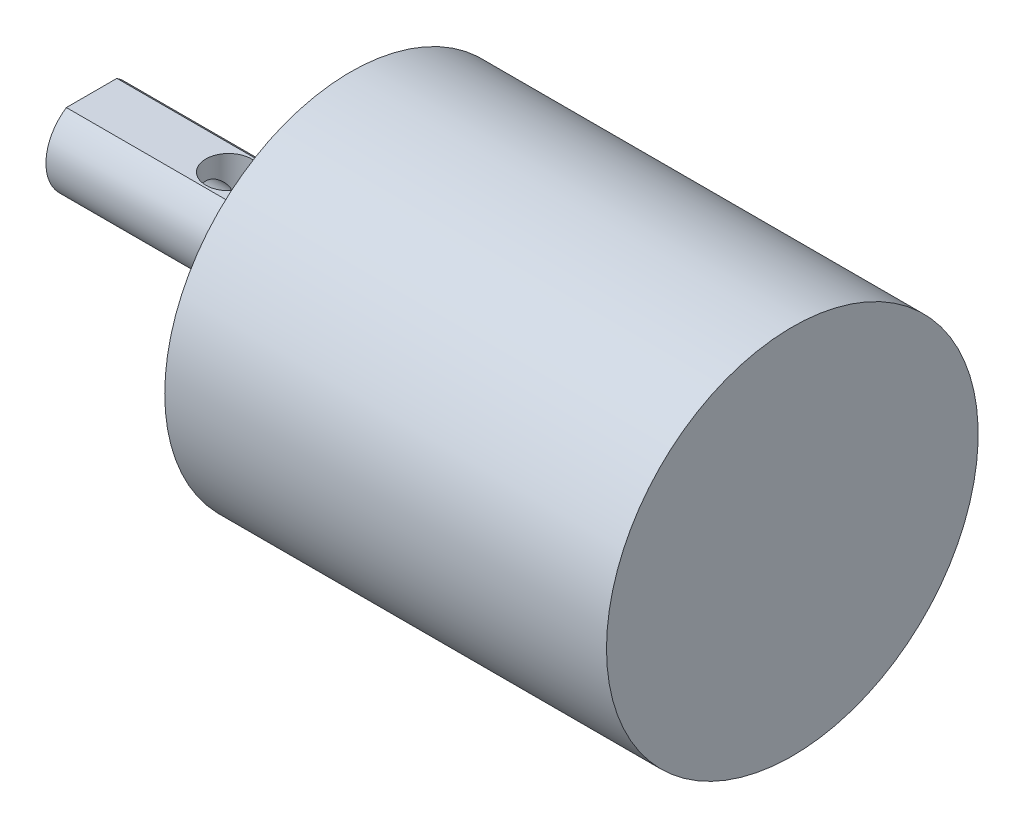
ISO-10303-21;
HEADER;
FILE_DESCRIPTION(('STEP AP214'),'2;1');
FILE_NAME('part.step','',(''),(''),'','','');
FILE_SCHEMA(('AUTOMOTIVE_DESIGN { 1 0 10303 214 1 1 1 1 }'));
ENDSEC;
DATA;
#1=APPLICATION_CONTEXT('core data for automotive mechanical design processes');
#2=APPLICATION_PROTOCOL_DEFINITION('international standard','automotive_design',2000,#1);
#3=PRODUCT_CONTEXT('',#1,'mechanical');
#4=PRODUCT('Part','Part','',(#3));
#5=PRODUCT_RELATED_PRODUCT_CATEGORY('part','',(#4));
#6=PRODUCT_DEFINITION_FORMATION('','',#4);
#7=PRODUCT_DEFINITION_CONTEXT('part definition',#1,'design');
#8=PRODUCT_DEFINITION('design','',#6,#7);
#9=PRODUCT_DEFINITION_SHAPE('','',#8);
#10=(LENGTH_UNIT() NAMED_UNIT(*) SI_UNIT(.MILLI.,.METRE.));
#11=(NAMED_UNIT(*) PLANE_ANGLE_UNIT() SI_UNIT($,.RADIAN.));
#12=(NAMED_UNIT(*) SI_UNIT($,.STERADIAN.) SOLID_ANGLE_UNIT());
#13=UNCERTAINTY_MEASURE_WITH_UNIT(LENGTH_MEASURE(1.E-05),#10,'distance_accuracy_value','');
#14=(GEOMETRIC_REPRESENTATION_CONTEXT(3) GLOBAL_UNCERTAINTY_ASSIGNED_CONTEXT((#13)) GLOBAL_UNIT_ASSIGNED_CONTEXT((#10,
#11,#12)) REPRESENTATION_CONTEXT('',''));
#15=CARTESIAN_POINT('',(0.,0.,0.));
#16=DIRECTION('',(0.,0.,1.));
#17=DIRECTION('',(1.,0.,0.));
#18=AXIS2_PLACEMENT_3D('',#15,#16,#17);
#19=CARTESIAN_POINT('',(-31.6,0.,-5.7));
#20=DIRECTION('',(-1.,0.,0.));
#21=DIRECTION('',(0.,0.,1.));
#22=AXIS2_PLACEMENT_3D('',#19,#20,#21);
#23=PLANE('',#22);
#24=CARTESIAN_POINT('',(-31.6,0.,-12.2));
#25=DIRECTION('',(-1.,0.,0.));
#26=DIRECTION('',(0.,0.,1.));
#27=AXIS2_PLACEMENT_3D('',#24,#25,#26);
#28=CIRCLE('',#27,6.5);
#29=CARTESIAN_POINT('',(-31.6,0.,-5.7));
#30=VERTEX_POINT('',#29);
#31=EDGE_CURVE('E246',#30,#30,#28,.T.);
#32=ORIENTED_EDGE('',*,*,#31,.T.);
#33=EDGE_LOOP('',(#32));
#34=FACE_BOUND('',#33,.T.);
#35=CARTESIAN_POINT('',(-31.6,0.,-12.2));
#36=DIRECTION('',(-1.,0.,0.));
#37=DIRECTION('',(0.,0.,1.));
#38=AXIS2_PLACEMENT_3D('',#35,#36,#37);
#39=CIRCLE('',#38,6.);
#40=CARTESIAN_POINT('',(-31.6,-6.,-12.2));
#41=VERTEX_POINT('',#40);
#42=CARTESIAN_POINT('',(-31.6,-1.5,-18.0094750193111));
#43=VERTEX_POINT('',#42);
#44=EDGE_CURVE('E436',#41,#43,#39,.T.);
#45=ORIENTED_EDGE('',*,*,#44,.F.);
#46=DIRECTION('',(0.,-0.866025403784439,-0.5));
#47=VECTOR('',#46,1.);
#48=CARTESIAN_POINT('',(-31.6,-1.5,-9.60192378864668));
#49=LINE('',#48,#47);
#50=CARTESIAN_POINT('',(-31.6,-1.5,-9.60192378864668));
#51=VERTEX_POINT('',#50);
#52=EDGE_CURVE('E137',#51,#41,#49,.T.);
#53=ORIENTED_EDGE('',*,*,#52,.F.);
#54=CARTESIAN_POINT('',(-31.6,0.,-12.2));
#55=DIRECTION('',(-1.,0.,0.));
#56=DIRECTION('',(0.,0.,1.));
#57=AXIS2_PLACEMENT_3D('',#54,#55,#56);
#58=CIRCLE('',#57,3.);
#59=CARTESIAN_POINT('',(-31.6,1.67021358881229,-14.692064719815));
#60=VERTEX_POINT('',#59);
#61=EDGE_CURVE('E251',#60,#51,#58,.T.);
#62=ORIENTED_EDGE('',*,*,#61,.F.);
#63=DIRECTION('',(0.,0.690885537617151,0.722964158109834));
#64=VECTOR('',#63,1.);
#65=CARTESIAN_POINT('',(-31.6,-1.5,-18.0094750193111));
#66=LINE('',#65,#64);
#67=EDGE_CURVE('E133',#43,#60,#66,.T.);
#68=ORIENTED_EDGE('',*,*,#67,.F.);
#69=EDGE_LOOP('',(#45,#53,#62,#68));
#70=FACE_BOUND('',#69,.T.);
#71=ADVANCED_FACE('F38',(#34,#70),#23,.T.);
#72=CARTESIAN_POINT('',(-38.,0.,-12.2));
#73=DIRECTION('',(-1.,0.,0.));
#74=DIRECTION('',(0.,0.,1.));
#75=AXIS2_PLACEMENT_3D('',#72,#73,#74);
#76=CONICAL_SURFACE('',#75,1.25,1.02974425867665);
#77=CARTESIAN_POINT('',(-38.,0.,-12.2));
#78=DIRECTION('',(-1.,0.,0.));
#79=DIRECTION('',(0.,0.,1.));
#80=AXIS2_PLACEMENT_3D('',#77,#78,#79);
#81=CIRCLE('',#80,1.25);
#82=CARTESIAN_POINT('',(-38.0000000000002,-0.559016994375681,-11.0819660112501));
#83=VERTEX_POINT('',#82);
#84=CARTESIAN_POINT('',(-38.,0.559016994374936,-11.0819660112501));
#85=VERTEX_POINT('',#84);
#86=EDGE_CURVE('E271',#83,#85,#81,.T.);
#87=ORIENTED_EDGE('',*,*,#86,.T.);
#88=CARTESIAN_POINT('',(-38.3344942997963,1.67182864536561,-11.5150730230041));
#89=CARTESIAN_POINT('',(-38.3163163138104,1.62461337100579,-11.4797356637797));
#90=CARTESIAN_POINT('',(-38.2978025805194,1.57566748458989,-11.4470411675325));
#91=CARTESIAN_POINT('',(-38.2606698289528,1.47505980079488,-11.3863641640652));
#92=CARTESIAN_POINT('',(-38.2420509887325,1.42340179901578,-11.3583752904652));
#93=CARTESIAN_POINT('',(-38.2053815652402,1.31844030869776,-11.3066681871802));
#94=CARTESIAN_POINT('',(-38.1873274518685,1.26515499935318,-11.2829149906069));
#95=CARTESIAN_POINT('',(-38.1520698863836,1.15684785990351,-11.2389955295993));
#96=CARTESIAN_POINT('',(-38.1348665247677,1.10182584607487,-11.2188296461695));
#97=CARTESIAN_POINT('',(-38.1033852794018,0.995697674053194,-11.1836131249123));
#98=CARTESIAN_POINT('',(-38.0889854408683,0.944728558681499,-11.1682561957033));
#99=CARTESIAN_POINT('',(-38.0597967193166,0.834790629296757,-11.1382438108772));
#100=CARTESIAN_POINT('',(-38.0452143086519,0.775665123675573,-11.1239581583983));
#101=CARTESIAN_POINT('',(-38.0184820113222,0.656159826572658,-11.0986219232742));
#102=CARTESIAN_POINT('',(-38.0063328702622,0.595779656871998,-11.087572331748));
#103=CARTESIAN_POINT('',(-37.985068558722,0.473955034575553,-11.0686985515051));
#104=CARTESIAN_POINT('',(-37.9759545724139,0.4125101764022,-11.0608756213938));
#105=CARTESIAN_POINT('',(-37.9613193541442,0.288888231348505,-11.0484978839004));
#106=CARTESIAN_POINT('',(-37.9557966272631,0.226711460126279,-11.0439417165944));
#107=CARTESIAN_POINT('',(-37.9481562249803,0.091785197213377,-11.037661195289));
#108=CARTESIAN_POINT('',(-37.9467411664683,0.0189659304869583,-11.0365201930432));
#109=CARTESIAN_POINT('',(-37.9494510655884,-0.126516316671805,-11.0387314295013));
#110=CARTESIAN_POINT('',(-37.9535776368067,-0.199179245411043,-11.0420849769067));
#111=CARTESIAN_POINT('',(-37.9669516642124,-0.343608566475454,-11.0532312688894));
#112=CARTESIAN_POINT('',(-37.9761946558375,-0.415375684730054,-11.0610201433929));
#113=CARTESIAN_POINT('',(-37.9989997200573,-0.557598976481524,-11.0809702950655));
#114=CARTESIAN_POINT('',(-38.0125620504795,-0.628055071455721,-11.0931318332509));
#115=CARTESIAN_POINT('',(-38.0350335922642,-0.730650743837737,-11.1142728399031));
#116=CARTESIAN_POINT('',(-38.0426353188876,-0.763441414072057,-11.1215586180901));
#117=CARTESIAN_POINT('',(-38.0584991446648,-0.828625285516783,-11.1371254386979));
#118=CARTESIAN_POINT('',(-38.0667613479999,-0.861018423088503,-11.1454066382372));
#119=CARTESIAN_POINT('',(-38.1063239543244,-1.01004829929829,-11.1860779268992));
#120=CARTESIAN_POINT('',(-38.1410813614023,-1.12425046766659,-11.2246088087335));
#121=CARTESIAN_POINT('',(-38.1956152274618,-1.28982918043749,-11.2937109068293));
#122=CARTESIAN_POINT('',(-38.214186750954,-1.34405225523453,-11.3186198725106));
#123=CARTESIAN_POINT('',(-38.2516536768637,-1.45020701245779,-11.3726873564154));
#124=CARTESIAN_POINT('',(-38.2705487937918,-1.50214058342003,-11.4018422834869));
#125=CARTESIAN_POINT('',(-38.3008539365346,-1.5835547390461,-11.4528133549099));
#126=CARTESIAN_POINT('',(-38.312335790628,-1.61395901587832,-11.4731137747238));
#127=CARTESIAN_POINT('',(-38.3350582152167,-1.67341145439771,-11.5157501672098));
#128=CARTESIAN_POINT('',(-38.3462987070951,-1.70245917773979,-11.5380867910544));
#129=CARTESIAN_POINT('',(-38.357337512517,-1.73069876832922,-11.561537098091));
#130=B_SPLINE_CURVE_WITH_KNOTS('',3,(#88,#89,#90,#91,#92,#93,#94,#95,#96,#97,#98,#99,#100,#101,
#102,#103,#104,#105,#106,#107,#108,#109,#110,#111,#112,#113,#114,#115,#116,#117,#118,#119,#120,
#121,#122,#123,#124,#125,#126,#127,#128,#129),.UNSPECIFIED.,.F.,.F.,(4,2,2,2,2,2,2,2,2,2,2,2,2,
2,2,2,2,2,2,2,4),(0.,0.184926237952774,0.369600234320969,0.552670945769802,0.735761089354847,
0.901113760928823,1.08862563519459,1.27619487943242,1.46383721870861,1.65140139875104,
1.86956952844741,2.08780119710176,2.3058427374226,2.52389729539921,2.62719498618184,
2.73050900306382,3.10546108420719,3.29282233419519,3.48002602819094,3.59491325714074,
3.70983735647541),.UNSPECIFIED.);
#131=EDGE_CURVE('E67',#85,#83,#130,.T.);
#132=ORIENTED_EDGE('',*,*,#131,.T.);
#133=EDGE_LOOP('',(#87,#132));
#134=FACE_BOUND('',#133,.T.);
#135=ADVANCED_FACE('F214',(#134),#76,.F.);
#136=CARTESIAN_POINT('',(-46.,0.,-12.2));
#137=DIRECTION('',(-1.,0.,0.));
#138=DIRECTION('',(0.,0.,1.));
#139=AXIS2_PLACEMENT_3D('',#136,#137,#138);
#140=CYLINDRICAL_SURFACE('',#139,3.);
#141=DIRECTION('',(1.,0.,0.));
#142=VECTOR('',#141,1.);
#143=CARTESIAN_POINT('',(-32.1,-1.5,-9.60192378864668));
#144=LINE('',#143,#142);
#145=CARTESIAN_POINT('',(-32.1,-1.5,-9.60192378864668));
#146=VERTEX_POINT('',#145);
#147=EDGE_CURVE('E439',#146,#51,#144,.T.);
#148=ORIENTED_EDGE('',*,*,#147,.F.);
#149=CARTESIAN_POINT('',(-32.1,0.,-12.2));
#150=DIRECTION('',(1.,0.,0.));
#151=DIRECTION('',(0.,0.,-1.));
#152=AXIS2_PLACEMENT_3D('',#149,#150,#151);
#153=CIRCLE('',#152,3.);
#154=CARTESIAN_POINT('',(-32.1,1.67021358881229,-14.692064719815));
#155=VERTEX_POINT('',#154);
#156=EDGE_CURVE('E130',#155,#146,#153,.T.);
#157=ORIENTED_EDGE('',*,*,#156,.F.);
#158=DIRECTION('',(1.,0.,0.));
#159=VECTOR('',#158,1.);
#160=CARTESIAN_POINT('',(-32.1,1.67021358881229,-14.692064719815));
#161=LINE('',#160,#159);
#162=EDGE_CURVE('E144',#155,#60,#161,.T.);
#163=ORIENTED_EDGE('',*,*,#162,.T.);
#164=ORIENTED_EDGE('',*,*,#61,.T.);
#165=EDGE_LOOP('',(#148,#157,#163,#164));
#166=FACE_BOUND('',#165,.T.);
#167=CARTESIAN_POINT('',(-37.,-2.59807621135331,-10.7));
#168=CARTESIAN_POINT('',(-37.0781617122929,-2.59808302092688,-10.7000054553882));
#169=CARTESIAN_POINT('',(-37.1564221172876,-2.60165701781634,-10.7061500439002));
#170=CARTESIAN_POINT('',(-37.3105408970157,-2.61543549678078,-10.7304151851529));
#171=CARTESIAN_POINT('',(-37.3863938725651,-2.62565391083339,-10.7485609031687));
#172=CARTESIAN_POINT('',(-37.5331774965159,-2.65124019908097,-10.7958500769503));
#173=CARTESIAN_POINT('',(-37.6041319787104,-2.66658065209878,-10.8249350712594));
#174=CARTESIAN_POINT('',(-37.7401363029951,-2.70063997225286,-10.8930987119354));
#175=CARTESIAN_POINT('',(-37.8051858253937,-2.71935902214096,-10.9321778989463));
#176=CARTESIAN_POINT('',(-37.9334585928363,-2.75995303586162,-11.0230001892037));
#177=CARTESIAN_POINT('',(-37.9960887035103,-2.7819609545693,-11.0755219457843));
#178=CARTESIAN_POINT('',(-38.1121125826101,-2.82557974178558,-11.1901192885783));
#179=CARTESIAN_POINT('',(-38.1655017438753,-2.84719040746875,-11.2521996113266));
#180=CARTESIAN_POINT('',(-38.2650507267215,-2.88932215429424,-11.3892656548782));
#181=CARTESIAN_POINT('',(-38.3104806517893,-2.90967159627259,-11.4648392164811));
#182=CARTESIAN_POINT('',(-38.3877112798686,-2.94526134149294,-11.6237644601007));
#183=CARTESIAN_POINT('',(-38.4195205842058,-2.96050486775612,-11.7071111927928));
#184=CARTESIAN_POINT('',(-38.4662569919517,-2.98320691866356,-11.872932584111));
#185=CARTESIAN_POINT('',(-38.4822242895333,-2.99114220331338,-11.9550473142668));
#186=CARTESIAN_POINT('',(-38.5002491780126,-3.000113757691,-12.1211440569532));
#187=CARTESIAN_POINT('',(-38.5023151851936,-3.00115420176885,-12.2051249087656));
#188=CARTESIAN_POINT('',(-38.4928799890445,-2.99644472874675,-12.3647487866356));
#189=CARTESIAN_POINT('',(-38.4825429767182,-2.99127743838241,-12.4404817987652));
#190=CARTESIAN_POINT('',(-38.450678734143,-2.97561367889621,-12.5889706578775));
#191=CARTESIAN_POINT('',(-38.4291506665357,-2.96511681099591,-12.6617262816409));
#192=CARTESIAN_POINT('',(-38.3753761508653,-2.93957374931481,-12.8034640873543));
#193=CARTESIAN_POINT('',(-38.3429855302419,-2.92446662293799,-12.8723801352728));
#194=CARTESIAN_POINT('',(-38.2686048756978,-2.89106468980031,-13.00396520227));
#195=CARTESIAN_POINT('',(-38.2266114050465,-2.87276874236226,-13.066631973258));
#196=CARTESIAN_POINT('',(-38.1296569727005,-2.83266591598844,-13.1902604913473));
#197=CARTESIAN_POINT('',(-38.073845457511,-2.81069063997262,-13.250501112544));
#198=CARTESIAN_POINT('',(-37.9531154126047,-2.76681510880217,-13.3611565554467));
#199=CARTESIAN_POINT('',(-37.8881899415889,-2.74491492398443,-13.4115638173613));
#200=CARTESIAN_POINT('',(-37.7460277113639,-2.70216234138727,-13.5042580019633));
#201=CARTESIAN_POINT('',(-37.6682709654187,-2.68146479986061,-13.5458259724671));
#202=CARTESIAN_POINT('',(-37.5055934929615,-2.64563175417864,-13.6149786695018));
#203=CARTESIAN_POINT('',(-37.4206803504737,-2.63049045069101,-13.6425779873163));
#204=CARTESIAN_POINT('',(-37.2531782330758,-2.60916953725551,-13.6807703165376));
#205=CARTESIAN_POINT('',(-37.1709383214347,-2.60237483772744,-13.69253768318));
#206=CARTESIAN_POINT('',(-37.0053979877252,-2.59676879042414,-13.7022754199171));
#207=CARTESIAN_POINT('',(-36.9220983563203,-2.59795180333967,-13.7002555359725));
#208=CARTESIAN_POINT('',(-36.7665191221319,-2.60751504810877,-13.6835540650159));
#209=CARTESIAN_POINT('',(-36.6940308233381,-2.61509381259981,-13.6702817250687));
#210=CARTESIAN_POINT('',(-36.5524483205936,-2.63541032327012,-13.6335444269487));
#211=CARTESIAN_POINT('',(-36.4833552238801,-2.64814974007551,-13.6100761679354));
#212=CARTESIAN_POINT('',(-36.3468830036459,-2.67804333119485,-13.5524713829073));
#213=CARTESIAN_POINT('',(-36.2797314747197,-2.69537464864595,-13.5178910955391));
#214=CARTESIAN_POINT('',(-36.1517960926915,-2.73234179245874,-13.4394305960237));
#215=CARTESIAN_POINT('',(-36.0910155347301,-2.75197880032721,-13.3955456064983));
#216=CARTESIAN_POINT('',(-35.9695318487147,-2.79431997684504,-13.2932557507983));
#217=CARTESIAN_POINT('',(-35.9098042739235,-2.81709874731434,-13.2337179084724));
#218=CARTESIAN_POINT('',(-35.8008816430096,-2.86101352466839,-13.1051067430974));
#219=CARTESIAN_POINT('',(-35.7516901446542,-2.88214897511564,-13.036030211983));
#220=CARTESIAN_POINT('',(-35.6641394110748,-2.92112042536435,-12.8878030438381));
#221=CARTESIAN_POINT('',(-35.6261003226836,-2.93885462508044,-12.8084346463612));
#222=CARTESIAN_POINT('',(-35.5642931442139,-2.96825032438951,-12.6432835469616));
#223=CARTESIAN_POINT('',(-35.5405125229505,-2.9799171551456,-12.5575065520883));
#224=CARTESIAN_POINT('',(-35.509947153738,-2.99501262272824,-12.3904695234956));
#225=CARTESIAN_POINT('',(-35.5018031861858,-2.99909891862287,-12.3095171657757));
#226=CARTESIAN_POINT('',(-35.4987351018184,-3.00063195562697,-12.1473110210732));
#227=CARTESIAN_POINT('',(-35.5038063572146,-2.99808102100335,-12.0660573495574));
#228=CARTESIAN_POINT('',(-35.5261246101934,-2.98700953256884,-11.9111930115243));
#229=CARTESIAN_POINT('',(-35.5425472738865,-2.97889342001985,-11.8374315232831));
#230=CARTESIAN_POINT('',(-35.5859904989545,-2.95788140495135,-11.6938310717246));
#231=CARTESIAN_POINT('',(-35.6130125801402,-2.94498481699193,-11.6239926725667));
#232=CARTESIAN_POINT('',(-35.6780905782489,-2.9148889612218,-11.4868648906327));
#233=CARTESIAN_POINT('',(-35.7165689848118,-2.89752925798198,-11.4198122859499));
#234=CARTESIAN_POINT('',(-35.8029368962886,-2.86032199712739,-11.292838037279));
#235=CARTESIAN_POINT('',(-35.8508307236735,-2.84047329837541,-11.2329196888776));
#236=CARTESIAN_POINT('',(-35.9601957085341,-2.79792915339941,-11.1156289937647));
#237=CARTESIAN_POINT('',(-36.0225437312158,-2.77514698517547,-11.0591034731911));
#238=CARTESIAN_POINT('',(-36.1561760816947,-2.73094614244278,-10.957005068908));
#239=CARTESIAN_POINT('',(-36.2274682313015,-2.70952868642798,-10.9114418749849));
#240=CARTESIAN_POINT('',(-36.3799549698714,-2.66999407957374,-10.8313533803215));
#241=CARTESIAN_POINT('',(-36.4613912966931,-2.65200261384405,-10.7972224010586));
#242=CARTESIAN_POINT('',(-36.6299986065097,-2.62299234492527,-10.7436819357404));
#243=CARTESIAN_POINT('',(-36.717149333369,-2.61195024221553,-10.724223213237));
#244=CARTESIAN_POINT('',(-36.837708033478,-2.60293908902686,-10.7084494882034));
#245=CARTESIAN_POINT('',(-36.8700518415968,-2.60112193507727,-10.7052858425542));
#246=CARTESIAN_POINT('',(-36.9349247210234,-2.59868903831625,-10.701059892365));
#247=CARTESIAN_POINT('',(-36.9674538045788,-2.59807337587664,-10.6999977284002));
#248=CARTESIAN_POINT('',(-37.,-2.59807621135331,-10.7));
#249=B_SPLINE_CURVE_WITH_KNOTS('',3,(#167,#168,#169,#170,#171,#172,#173,#174,#175,#176,#177,
#178,#179,#180,#181,#182,#183,#184,#185,#186,#187,#188,#189,#190,#191,#192,#193,#194,#195,#196,
#197,#198,#199,#200,#201,#202,#203,#204,#205,#206,#207,#208,#209,#210,#211,#212,#213,#214,#215,
#216,#217,#218,#219,#220,#221,#222,#223,#224,#225,#226,#227,#228,#229,#230,#231,#232,#233,#234,
#235,#236,#237,#238,#239,#240,#241,#242,#243,#244,#245,#246,#247,#248),.UNSPECIFIED.,.T.,.F.,(4,
2,2,2,2,2,2,2,2,2,2,2,2,2,2,2,2,2,2,2,2,2,2,2,2,2,2,2,2,2,2,2,2,2,2,2,2,2,2,2,4),(0.,
0.234348183892079,0.469189339237211,0.70279289387832,0.936409088167718,1.18929346874735,
1.44230356626557,1.71236838358146,1.98226240445838,2.23295227451904,2.48349035529061,
2.71224146226808,2.94100968776184,3.17294302096721,3.40495949025409,3.65890787185338,
3.91305072368879,4.18333262594173,4.45333161317559,4.70193436281319,4.95036139782561,
5.17161275136041,5.39293578654097,5.62450944609134,5.85620229330073,6.11710115370922,
6.37808797467306,6.64596272119451,6.9136016971316,7.15668405584232,7.3996813019096,
7.62666637307241,7.85368400268022,8.0904112607921,8.32724745151081,8.58765362775104,
8.84828914267734,9.11716123557911,9.38512699504143,9.48270202777967,9.58028358741813),.UNSPECIFIED.);
#250=CARTESIAN_POINT('',(-37.,-2.59807621135331,-10.7));
#251=VERTEX_POINT('',#250);
#252=EDGE_CURVE('E199',#251,#251,#249,.T.);
#253=ORIENTED_EDGE('',*,*,#252,.F.);
#254=EDGE_LOOP('',(#253));
#255=FACE_BOUND('',#254,.T.);
#256=CARTESIAN_POINT('',(-46.,0.,-12.2));
#257=DIRECTION('',(-1.,0.,0.));
#258=DIRECTION('',(0.,0.,1.));
#259=AXIS2_PLACEMENT_3D('',#256,#257,#258);
#260=CIRCLE('',#259,3.);
#261=CARTESIAN_POINT('',(-46.,2.5,-13.8583123951777));
#262=VERTEX_POINT('',#261);
#263=CARTESIAN_POINT('',(-46.,2.5,-10.5416876048223));
#264=VERTEX_POINT('',#263);
#265=EDGE_CURVE('E254',#262,#264,#260,.T.);
#266=ORIENTED_EDGE('',*,*,#265,.F.);
#267=DIRECTION('',(-1.,0.,0.));
#268=VECTOR('',#267,1.);
#269=CARTESIAN_POINT('',(-34.5,2.5,-13.8583123951777));
#270=LINE('',#269,#268);
#271=CARTESIAN_POINT('',(-34.5,2.5,-13.8583123951777));
#272=VERTEX_POINT('',#271);
#273=EDGE_CURVE('E257',#272,#262,#270,.T.);
#274=ORIENTED_EDGE('',*,*,#273,.F.);
#275=CARTESIAN_POINT('',(-34.5,0.,-12.2));
#276=DIRECTION('',(-1.,0.,0.));
#277=DIRECTION('',(0.,0.,1.));
#278=AXIS2_PLACEMENT_3D('',#275,#276,#277);
#279=CIRCLE('',#278,3.00000000000002);
#280=CARTESIAN_POINT('',(-34.5,2.5,-10.5416876048223));
#281=VERTEX_POINT('',#280);
#282=EDGE_CURVE('E261',#281,#272,#279,.T.);
#283=ORIENTED_EDGE('',*,*,#282,.F.);
#284=DIRECTION('',(-1.,0.,0.));
#285=VECTOR('',#284,1.);
#286=CARTESIAN_POINT('',(-34.5,2.5,-10.5416876048223));
#287=LINE('',#286,#285);
#288=EDGE_CURVE('E258',#281,#264,#287,.T.);
#289=ORIENTED_EDGE('',*,*,#288,.T.);
#290=EDGE_LOOP('',(#266,#274,#283,#289));
#291=FACE_BOUND('',#290,.T.);
#292=ADVANCED_FACE('F208',(#166,#255,#291),#140,.T.);
#293=CARTESIAN_POINT('',(-46.,0.,-9.19999999999999));
#294=DIRECTION('',(-1.,0.,0.));
#295=DIRECTION('',(0.,0.,1.));
#296=AXIS2_PLACEMENT_3D('',#293,#294,#295);
#297=PLANE('',#296);
#298=CARTESIAN_POINT('',(-46.,0.,-12.2));
#299=DIRECTION('',(-1.,0.,0.));
#300=DIRECTION('',(0.,0.,1.));
#301=AXIS2_PLACEMENT_3D('',#298,#299,#300);
#302=CIRCLE('',#301,1.25);
#303=CARTESIAN_POINT('',(-46.,0.,-10.95));
#304=VERTEX_POINT('',#303);
#305=EDGE_CURVE('E206',#304,#304,#302,.T.);
#306=ORIENTED_EDGE('',*,*,#305,.F.);
#307=EDGE_LOOP('',(#306));
#308=FACE_BOUND('',#307,.T.);
#309=ORIENTED_EDGE('',*,*,#265,.T.);
#310=DIRECTION('',(0.,0.,-1.));
#311=VECTOR('',#310,1.);
#312=CARTESIAN_POINT('',(-46.,2.5,-12.2));
#313=LINE('',#312,#311);
#314=EDGE_CURVE('E263',#264,#262,#313,.T.);
#315=ORIENTED_EDGE('',*,*,#314,.T.);
#316=EDGE_LOOP('',(#309,#315));
#317=FACE_BOUND('',#316,.T.);
#318=ADVANCED_FACE('F213',(#308,#317),#297,.T.);
#319=CARTESIAN_POINT('',(0.,0.,-12.2));
#320=DIRECTION('',(1.,0.,0.));
#321=DIRECTION('',(0.,0.,-1.));
#322=AXIS2_PLACEMENT_3D('',#319,#320,#321);
#323=PLANE('',#322);
#324=CARTESIAN_POINT('',(0.,0.,-12.2));
#325=DIRECTION('',(-1.,0.,0.));
#326=DIRECTION('',(0.,0.,1.));
#327=AXIS2_PLACEMENT_3D('',#324,#325,#326);
#328=CIRCLE('',#327,12.2);
#329=CARTESIAN_POINT('',(0.,0.,0.));
#330=VERTEX_POINT('',#329);
#331=EDGE_CURVE('E238',#330,#330,#328,.T.);
#332=ORIENTED_EDGE('',*,*,#331,.F.);
#333=EDGE_LOOP('',(#332));
#334=FACE_BOUND('',#333,.T.);
#335=ADVANCED_FACE('F40',(#334),#323,.T.);
#336=CARTESIAN_POINT('',(-46.,0.,-12.2));
#337=DIRECTION('',(-1.,0.,0.));
#338=DIRECTION('',(0.,0.,1.));
#339=AXIS2_PLACEMENT_3D('',#336,#337,#338);
#340=CYLINDRICAL_SURFACE('',#339,12.2);
#341=ORIENTED_EDGE('',*,*,#331,.T.);
#342=EDGE_LOOP('',(#341));
#343=FACE_BOUND('',#342,.T.);
#344=CARTESIAN_POINT('',(-29.,0.,-12.2));
#345=DIRECTION('',(-1.,0.,0.));
#346=DIRECTION('',(0.,0.,1.));
#347=AXIS2_PLACEMENT_3D('',#344,#345,#346);
#348=CIRCLE('',#347,12.2);
#349=CARTESIAN_POINT('',(-29.,0.,0.));
#350=VERTEX_POINT('',#349);
#351=EDGE_CURVE('E241',#350,#350,#348,.T.);
#352=ORIENTED_EDGE('',*,*,#351,.F.);
#353=EDGE_LOOP('',(#352));
#354=FACE_BOUND('',#353,.T.);
#355=ADVANCED_FACE('F227',(#343,#354),#340,.T.);
#356=CARTESIAN_POINT('',(-29.,0.,0.));
#357=DIRECTION('',(-1.,0.,0.));
#358=DIRECTION('',(0.,0.,1.));
#359=AXIS2_PLACEMENT_3D('',#356,#357,#358);
#360=PLANE('',#359);
#361=CARTESIAN_POINT('',(-29.,9.5,-12.2));
#362=DIRECTION('',(-1.,0.,0.));
#363=DIRECTION('',(0.,0.,1.));
#364=AXIS2_PLACEMENT_3D('',#361,#362,#363);
#365=CIRCLE('',#364,1.25);
#366=CARTESIAN_POINT('',(-29.,9.5,-10.95));
#367=VERTEX_POINT('',#366);
#368=EDGE_CURVE('E139',#367,#367,#365,.T.);
#369=ORIENTED_EDGE('',*,*,#368,.F.);
#370=EDGE_LOOP('',(#369));
#371=FACE_BOUND('',#370,.T.);
#372=CARTESIAN_POINT('',(-29.,-4.75000000000016,-20.4272413359518));
#373=DIRECTION('',(-1.,0.,0.));
#374=DIRECTION('',(0.,0.,1.));
#375=AXIS2_PLACEMENT_3D('',#372,#373,#374);
#376=CIRCLE('',#375,1.25);
#377=CARTESIAN_POINT('',(-29.,-4.75000000000016,-19.1772413359518));
#378=VERTEX_POINT('',#377);
#379=EDGE_CURVE('E150',#378,#378,#376,.T.);
#380=ORIENTED_EDGE('',*,*,#379,.F.);
#381=EDGE_LOOP('',(#380));
#382=FACE_BOUND('',#381,.T.);
#383=CARTESIAN_POINT('',(-29.,-4.74999999999981,-3.97275866404745));
#384=DIRECTION('',(-1.,0.,0.));
#385=DIRECTION('',(0.,0.,1.));
#386=AXIS2_PLACEMENT_3D('',#383,#384,#385);
#387=CIRCLE('',#386,1.25);
#388=CARTESIAN_POINT('',(-29.,-4.74999999999981,-2.72275866404745));
#389=VERTEX_POINT('',#388);
#390=EDGE_CURVE('E156',#389,#389,#387,.T.);
#391=ORIENTED_EDGE('',*,*,#390,.F.);
#392=EDGE_LOOP('',(#391));
#393=FACE_BOUND('',#392,.T.);
#394=ORIENTED_EDGE('',*,*,#351,.T.);
#395=EDGE_LOOP('',(#394));
#396=FACE_BOUND('',#395,.T.);
#397=CARTESIAN_POINT('',(-29.,0.,-12.2));
#398=DIRECTION('',(-1.,0.,0.));
#399=DIRECTION('',(0.,0.,1.));
#400=AXIS2_PLACEMENT_3D('',#397,#398,#399);
#401=CIRCLE('',#400,6.5);
#402=CARTESIAN_POINT('',(-29.,0.,-5.7));
#403=VERTEX_POINT('',#402);
#404=EDGE_CURVE('E243',#403,#403,#401,.T.);
#405=ORIENTED_EDGE('',*,*,#404,.F.);
#406=EDGE_LOOP('',(#405));
#407=FACE_BOUND('',#406,.T.);
#408=ADVANCED_FACE('F224',(#371,#382,#393,#396,#407),#360,.T.);
#409=CARTESIAN_POINT('',(-46.,0.,-12.2));
#410=DIRECTION('',(-1.,0.,0.));
#411=DIRECTION('',(0.,0.,1.));
#412=AXIS2_PLACEMENT_3D('',#409,#410,#411);
#413=CYLINDRICAL_SURFACE('',#412,6.5);
#414=ORIENTED_EDGE('',*,*,#404,.T.);
#415=EDGE_LOOP('',(#414));
#416=FACE_BOUND('',#415,.T.);
#417=ORIENTED_EDGE('',*,*,#31,.F.);
#418=EDGE_LOOP('',(#417));
#419=FACE_BOUND('',#418,.T.);
#420=ADVANCED_FACE('F220',(#416,#419),#413,.T.);
#421=CARTESIAN_POINT('',(-34.5,2.5,-12.2));
#422=DIRECTION('',(0.,1.,0.));
#423=DIRECTION('',(0.,0.,1.));
#424=AXIS2_PLACEMENT_3D('',#421,#422,#423);
#425=PLANE('',#424);
#426=CARTESIAN_POINT('',(-37.,2.5,-12.2));
#427=DIRECTION('',(0.,1.,0.));
#428=DIRECTION('',(0.,0.,1.));
#429=AXIS2_PLACEMENT_3D('',#426,#427,#428);
#430=CIRCLE('',#429,1.5);
#431=CARTESIAN_POINT('',(-37.,2.5,-10.7));
#432=VERTEX_POINT('',#431);
#433=EDGE_CURVE('E162',#432,#432,#430,.T.);
#434=ORIENTED_EDGE('',*,*,#433,.F.);
#435=EDGE_LOOP('',(#434));
#436=FACE_BOUND('',#435,.T.);
#437=ORIENTED_EDGE('',*,*,#314,.F.);
#438=ORIENTED_EDGE('',*,*,#288,.F.);
#439=DIRECTION('',(0.,0.,1.));
#440=VECTOR('',#439,1.);
#441=CARTESIAN_POINT('',(-34.5,2.5,-12.2));
#442=LINE('',#441,#440);
#443=EDGE_CURVE('E266',#272,#281,#442,.T.);
#444=ORIENTED_EDGE('',*,*,#443,.F.);
#445=ORIENTED_EDGE('',*,*,#273,.T.);
#446=EDGE_LOOP('',(#437,#438,#444,#445));
#447=FACE_BOUND('',#446,.T.);
#448=ADVANCED_FACE('F223',(#436,#447),#425,.T.);
#449=CARTESIAN_POINT('',(-34.5,0.,-12.2));
#450=DIRECTION('',(-1.,0.,0.));
#451=DIRECTION('',(0.,0.,1.));
#452=AXIS2_PLACEMENT_3D('',#449,#450,#451);
#453=PLANE('',#452);
#454=ORIENTED_EDGE('',*,*,#443,.T.);
#455=ORIENTED_EDGE('',*,*,#282,.T.);
#456=EDGE_LOOP('',(#454,#455));
#457=FACE_BOUND('',#456,.T.);
#458=ADVANCED_FACE('F288',(#457),#453,.T.);
#459=CARTESIAN_POINT('',(-38.,0.559016994374937,-13.3180339887499));
#460=VERTEX_POINT('',#459);
#461=CARTESIAN_POINT('',(-38.,-0.559016994374936,-13.3180339887499));
#462=VERTEX_POINT('',#461);
#463=EDGE_CURVE('E267',#460,#462,#81,.T.);
#464=ORIENTED_EDGE('',*,*,#463,.T.);
#465=CARTESIAN_POINT('',(-38.357337512518,-1.73069876833152,-12.8384629019133));
#466=CARTESIAN_POINT('',(-38.3416763680001,-1.69063064309795,-12.8716915870004));
#467=CARTESIAN_POINT('',(-38.3256263968215,-1.64898638281895,-12.90270939189));
#468=CARTESIAN_POINT('',(-38.2931943321079,-1.56323246878673,-12.960772046675));
#469=CARTESIAN_POINT('',(-38.2768128291763,-1.51912698891127,-12.9878233564981));
#470=CARTESIAN_POINT('',(-38.2442273933087,-1.42932804616627,-13.038324344716));
#471=CARTESIAN_POINT('',(-38.2280230338936,-1.38364840891032,-13.0617987050465));
#472=CARTESIAN_POINT('',(-38.1959923895335,-1.29071808090079,-13.1057275968026));
#473=CARTESIAN_POINT('',(-38.180166219204,-1.24346692399837,-13.1261812222423));
#474=CARTESIAN_POINT('',(-38.1488403957075,-1.14648877634816,-13.1647784543496));
#475=CARTESIAN_POINT('',(-38.1333577547654,-1.09672957094134,-13.1828546577088));
#476=CARTESIAN_POINT('',(-38.1034429657484,-0.995902077361143,-13.2163258088024));
#477=CARTESIAN_POINT('',(-38.0890127795902,-0.944831572768664,-13.2317158199153));
#478=CARTESIAN_POINT('',(-38.0597901609565,-0.834765877622229,-13.2617627901166));
#479=CARTESIAN_POINT('',(-38.0452021309592,-0.775615751968252,-13.276053735535));
#480=CARTESIAN_POINT('',(-38.0184608549412,-0.656060175526236,-13.3013977753959));
#481=CARTESIAN_POINT('',(-38.0063083418665,-0.595654352866291,-13.3124498956057));
#482=CARTESIAN_POINT('',(-37.9850490750211,-0.473828179755903,-13.3313182825982));
#483=CARTESIAN_POINT('',(-37.9759409967393,-0.412408282725226,-13.3391359569111));
#484=CARTESIAN_POINT('',(-37.9613147888408,-0.288836884752255,-13.3515058802131));
#485=CARTESIAN_POINT('',(-37.9557951711167,-0.226685697970261,-13.3560594828684));
#486=CARTESIAN_POINT('',(-37.9481574307883,-0.0918065462113296,-13.3623378106235));
#487=CARTESIAN_POINT('',(-37.9467419811499,-0.0190088054201476,-13.3634791348567));
#488=CARTESIAN_POINT('',(-37.9494478486807,0.12643025052508,-13.3612712019889));
#489=CARTESIAN_POINT('',(-37.953570737455,0.199071515416633,-13.3579206702421));
#490=CARTESIAN_POINT('',(-37.9669387067779,0.34350184489272,-13.3467796303437));
#491=CARTESIAN_POINT('',(-37.9761824300185,0.415291130151566,-13.3389902987071));
#492=CARTESIAN_POINT('',(-37.9989918813232,0.557558407005653,-13.319036814153));
#493=CARTESIAN_POINT('',(-38.0125578044437,0.628036339268966,-13.3068724637923));
#494=CARTESIAN_POINT('',(-38.0350375926652,0.730668698362949,-13.2857232532584));
#495=CARTESIAN_POINT('',(-38.0426436746983,0.76347652217629,-13.2784329649836));
#496=CARTESIAN_POINT('',(-38.0585087507992,0.828663982104102,-13.2628653542843));
#497=CARTESIAN_POINT('',(-38.0667671020886,0.861044003945561,-13.2545889995869));
#498=CARTESIAN_POINT('',(-38.0852584349279,0.930691248019206,-13.2355761122347));
#499=CARTESIAN_POINT('',(-38.0955922908871,0.967882494282018,-13.2246590123398));
#500=CARTESIAN_POINT('',(-38.1168864003965,1.04165264437685,-13.2014056560954));
#501=CARTESIAN_POINT('',(-38.1278468996048,1.07823130069329,-13.1890688412394));
#502=CARTESIAN_POINT('',(-38.1543936290504,1.16409250643103,-13.1580878401579));
#503=CARTESIAN_POINT('',(-38.1701934128306,1.21307829176472,-13.1387967934602));
#504=CARTESIAN_POINT('',(-38.2023670893229,1.30956375241499,-13.0972197297798));
#505=CARTESIAN_POINT('',(-38.2187409290717,1.35706356406877,-13.0749339885578));
#506=CARTESIAN_POINT('',(-38.2517895940856,1.45046724337832,-13.0269705296034));
#507=CARTESIAN_POINT('',(-38.2684652793174,1.49636486960582,-13.0012810893455));
#508=CARTESIAN_POINT('',(-38.3016838221897,1.585921789149,-12.9460823306311));
#509=CARTESIAN_POINT('',(-38.3182265055986,1.6295784555404,-12.9165686658986));
#510=CARTESIAN_POINT('',(-38.3344942997963,1.67182864536561,-12.8849269769958));
#511=B_SPLINE_CURVE_WITH_KNOTS('',3,(#465,#466,#467,#468,#469,#470,#471,#472,#473,#474,#475,
#476,#477,#478,#479,#480,#481,#482,#483,#484,#485,#486,#487,#488,#489,#490,#491,#492,#493,#494,
#495,#496,#497,#498,#499,#500,#501,#502,#503,#504,#505,#506,#507,#508,#509,#510),.UNSPECIFIED.,
.F.,.F.,(4,2,2,2,2,2,2,2,2,2,2,2,2,2,2,2,2,2,2,2,2,2,4),(0.,0.162895121918518,0.325521929902963,
0.486970099286134,0.648466592671878,0.813847906716484,0.979530025747582,1.16711999304251,
1.35476632927307,1.54233092155205,1.72981768252213,1.94792167188443,2.16608756532415,
2.38419566022831,2.6023135995141,2.70566975871945,2.80892530685714,2.92923257499457,
3.04958733404962,3.21438594021988,3.3791693816058,3.54453586110778,3.71009195761573),.UNSPECIFIED.);
#512=EDGE_CURVE('E165',#462,#460,#511,.T.);
#513=ORIENTED_EDGE('',*,*,#512,.T.);
#514=EDGE_LOOP('',(#464,#513));
#515=FACE_BOUND('',#514,.T.);
#516=ADVANCED_FACE('F178',(#515),#76,.F.);
#517=CARTESIAN_POINT('',(-46.,0.,-12.2));
#518=DIRECTION('',(-1.,0.,0.));
#519=DIRECTION('',(0.,0.,1.));
#520=AXIS2_PLACEMENT_3D('',#517,#518,#519);
#521=CYLINDRICAL_SURFACE('',#520,1.25);
#522=ORIENTED_EDGE('',*,*,#86,.F.);
#523=CARTESIAN_POINT('',(-38.,-0.559016994374937,-11.0819660112501));
#524=CARTESIAN_POINT('',(-38.0194867401772,-0.5938116353446,-11.0993819355741));
#525=CARTESIAN_POINT('',(-38.0395500242899,-0.627533050357172,-11.1182559236176));
#526=CARTESIAN_POINT('',(-38.0802292976327,-0.6928700668103,-11.1588838316317));
#527=CARTESIAN_POINT('',(-38.1008455350158,-0.724484699822701,-11.1806390624879));
#528=CARTESIAN_POINT('',(-38.1421753273605,-0.785860465048294,-11.2271617714466));
#529=CARTESIAN_POINT('',(-38.162888349999,-0.815604833168993,-11.2519518565902));
#530=CARTESIAN_POINT('',(-38.2037380548522,-0.872862085988991,-11.3043888842079));
#531=CARTESIAN_POINT('',(-38.2238748905018,-0.900375568406187,-11.3320350569102));
#532=CARTESIAN_POINT('',(-38.2756674154182,-0.969875806533162,-11.4088117052389));
#533=CARTESIAN_POINT('',(-38.3064602014297,-1.00987496618826,-11.4603810096638));
#534=CARTESIAN_POINT('',(-38.3631063638437,-1.08215411508672,-11.57089168387));
#535=CARTESIAN_POINT('',(-38.3889762773052,-1.11446004304221,-11.6298072307547));
#536=CARTESIAN_POINT('',(-38.4296504662953,-1.16472101850466,-11.742821604102));
#537=CARTESIAN_POINT('',(-38.4456152770018,-1.18422337211217,-11.7958086704342));
#538=CARTESIAN_POINT('',(-38.4718334910525,-1.21609063067817,-11.9052688078008));
#539=CARTESIAN_POINT('',(-38.4820884938496,-1.22845753448095,-11.9617408976686));
#540=CARTESIAN_POINT('',(-38.4960722752503,-1.24529297222234,-12.0769303374175));
#541=CARTESIAN_POINT('',(-38.499771424593,-1.24972564821476,-12.135656661469));
#542=CARTESIAN_POINT('',(-38.500207770124,-1.25024938539999,-12.2531705278088));
#543=CARTESIAN_POINT('',(-38.4969458256661,-1.24634147624605,-12.311958061645));
#544=CARTESIAN_POINT('',(-38.4842685606535,-1.23108449653816,-12.4232716716931));
#545=CARTESIAN_POINT('',(-38.4753350644915,-1.22031787904697,-12.4759359129924));
#546=CARTESIAN_POINT('',(-38.4524338706043,-1.19252918146529,-12.5784103736849));
#547=CARTESIAN_POINT('',(-38.4384660511753,-1.1755069501463,-12.6282205240471));
#548=CARTESIAN_POINT('',(-38.4051383905753,-1.13449025374566,-12.7277755818694));
#549=CARTESIAN_POINT('',(-38.3854511130566,-1.11006647127365,-12.7772317284504));
#550=CARTESIAN_POINT('',(-38.3423711562459,-1.0558084859981,-12.8713617539319));
#551=CARTESIAN_POINT('',(-38.3189734201437,-1.02596689135403,-12.916028964918));
#552=CARTESIAN_POINT('',(-38.2577871516318,-0.9462903537527,-13.0204762276954));
#553=CARTESIAN_POINT('',(-38.2184662406941,-0.893717359927136,-13.077273043476));
#554=CARTESIAN_POINT('',(-38.1377354201025,-0.780106476414977,-13.1796905401557));
#555=CARTESIAN_POINT('',(-38.0963267223181,-0.719073462217301,-13.2253176165531));
#556=CARTESIAN_POINT('',(-38.0465127213638,-0.638615223507807,-13.2747062239765));
#557=CARTESIAN_POINT('',(-38.0370529250604,-0.623009324567268,-13.2838298821681));
#558=CARTESIAN_POINT('',(-38.0183504367789,-0.591355929063154,-13.3014199965019));
#559=CARTESIAN_POINT('',(-38.0091073547793,-0.575309360322806,-13.3098877086027));
#560=CARTESIAN_POINT('',(-38.0000000000005,-0.559016994375569,-13.3180339887514));
#561=B_SPLINE_CURVE_WITH_KNOTS('',3,(#523,#524,#525,#526,#527,#528,#529,#530,#531,#532,#533,
#534,#535,#536,#537,#538,#539,#540,#541,#542,#543,#544,#545,#546,#547,#548,#549,#550,#551,#552,
#553,#554,#555,#556,#557,#558,#559,#560),.UNSPECIFIED.,.F.,.F.,(4,2,2,2,2,2,2,2,2,2,2,2,2,2,2,2,
2,2,4),(0.,0.130485614831922,0.261030802269519,0.392615521128763,0.524164867385224,
0.739784958918602,0.954667427152361,1.12996833178603,1.30522010573319,1.48126193160863,
1.65728202620879,1.8200483466679,1.98281860223685,2.1578759679148,2.33317399451223,
2.59227356874168,2.85122444056858,2.9124223567735,2.97350004024469),.UNSPECIFIED.);
#562=EDGE_CURVE('E11',#83,#462,#561,.T.);
#563=ORIENTED_EDGE('',*,*,#562,.T.);
#564=ORIENTED_EDGE('',*,*,#463,.F.);
#565=CARTESIAN_POINT('',(-38.,0.559016994374937,-13.3180339887499));
#566=CARTESIAN_POINT('',(-38.0194867401772,0.5938116353446,-13.3006180644259));
#567=CARTESIAN_POINT('',(-38.0395500242899,0.627533050357172,-13.2817440763824));
#568=CARTESIAN_POINT('',(-38.0802292976327,0.6928700668103,-13.2411161683683));
#569=CARTESIAN_POINT('',(-38.1008455350158,0.724484699822701,-13.2193609375121));
#570=CARTESIAN_POINT('',(-38.1421753273605,0.785860465048294,-13.1728382285534));
#571=CARTESIAN_POINT('',(-38.162888349999,0.815604833168993,-13.1480481434098));
#572=CARTESIAN_POINT('',(-38.2037380548522,0.872862085988991,-13.0956111157921));
#573=CARTESIAN_POINT('',(-38.2238748905018,0.900375568406187,-13.0679649430898));
#574=CARTESIAN_POINT('',(-38.2756674154182,0.969875806533162,-12.9911882947611));
#575=CARTESIAN_POINT('',(-38.3064602014297,1.00987496618826,-12.9396189903362));
#576=CARTESIAN_POINT('',(-38.3631063638437,1.08215411508672,-12.82910831613));
#577=CARTESIAN_POINT('',(-38.3889762773052,1.11446004304221,-12.7701927692453));
#578=CARTESIAN_POINT('',(-38.4296504662953,1.16472101850465,-12.6571783958979));
#579=CARTESIAN_POINT('',(-38.4456152770018,1.18422337211217,-12.6041913295658));
#580=CARTESIAN_POINT('',(-38.4718334910525,1.21609063067817,-12.4947311921992));
#581=CARTESIAN_POINT('',(-38.4820884938496,1.22845753448095,-12.4382591023314));
#582=CARTESIAN_POINT('',(-38.4960722752503,1.24529297222234,-12.3230696625825));
#583=CARTESIAN_POINT('',(-38.499771424593,1.24972564821476,-12.264343338531));
#584=CARTESIAN_POINT('',(-38.500207770124,1.25024938539999,-12.1468294721912));
#585=CARTESIAN_POINT('',(-38.4969458256661,1.24634147624605,-12.088041938355));
#586=CARTESIAN_POINT('',(-38.4842685606535,1.23108449653816,-11.9767283283069));
#587=CARTESIAN_POINT('',(-38.4753350644915,1.22031787904697,-11.9240640870076));
#588=CARTESIAN_POINT('',(-38.4524338706043,1.19252918146529,-11.8215896263151));
#589=CARTESIAN_POINT('',(-38.4384660511753,1.1755069501463,-11.7717794759529));
#590=CARTESIAN_POINT('',(-38.4051383905753,1.13449025374566,-11.6722244181306));
#591=CARTESIAN_POINT('',(-38.3854511130566,1.11006647127365,-11.6227682715495));
#592=CARTESIAN_POINT('',(-38.3423711562459,1.0558084859981,-11.5286382460681));
#593=CARTESIAN_POINT('',(-38.3189734201437,1.02596689135403,-11.483971035082));
#594=CARTESIAN_POINT('',(-38.2577871516318,0.9462903537527,-11.3795237723046));
#595=CARTESIAN_POINT('',(-38.2184662406941,0.893717359927136,-11.322726956524));
#596=CARTESIAN_POINT('',(-38.1377354201025,0.780106476414977,-11.2203094598443));
#597=CARTESIAN_POINT('',(-38.0963267223181,0.719073462217302,-11.1746823834469));
#598=CARTESIAN_POINT('',(-38.0465127213638,0.638615223507807,-11.1252937760235));
#599=CARTESIAN_POINT('',(-38.0370529250604,0.623009324567268,-11.1161701178319));
#600=CARTESIAN_POINT('',(-38.0183504367789,0.591355929063154,-11.0985800034981));
#601=CARTESIAN_POINT('',(-38.0091073547793,0.575309360322805,-11.0901122913973));
#602=CARTESIAN_POINT('',(-38.0000000000005,0.559016994375569,-11.0819660112486));
#603=B_SPLINE_CURVE_WITH_KNOTS('',3,(#565,#566,#567,#568,#569,#570,#571,#572,#573,#574,#575,
#576,#577,#578,#579,#580,#581,#582,#583,#584,#585,#586,#587,#588,#589,#590,#591,#592,#593,#594,
#595,#596,#597,#598,#599,#600,#601,#602),.UNSPECIFIED.,.F.,.F.,(4,2,2,2,2,2,2,2,2,2,2,2,2,2,2,2,
2,2,4),(0.,0.130485614831922,0.261030802269519,0.392615521128763,0.524164867385224,
0.739784958918602,0.954667427152361,1.12996833178603,1.30522010573319,1.48126193160863,
1.65728202620879,1.8200483466679,1.98281860223685,2.1578759679148,2.33317399451223,
2.59227356874168,2.85122444056858,2.9124223567735,2.97350004024469),.UNSPECIFIED.);
#604=EDGE_CURVE('E52',#460,#85,#603,.T.);
#605=ORIENTED_EDGE('',*,*,#604,.T.);
#606=EDGE_LOOP('',(#522,#563,#564,#605));
#607=FACE_BOUND('',#606,.T.);
#608=ORIENTED_EDGE('',*,*,#305,.T.);
#609=EDGE_LOOP('',(#608));
#610=FACE_BOUND('',#609,.T.);
#611=ADVANCED_FACE('F186',(#607,#610),#521,.F.);
#612=CARTESIAN_POINT('',(-37.,-9.,-12.2));
#613=DIRECTION('',(0.,1.,0.));
#614=DIRECTION('',(0.,0.,1.));
#615=AXIS2_PLACEMENT_3D('',#612,#613,#614);
#616=CYLINDRICAL_SURFACE('',#615,1.5);
#617=ORIENTED_EDGE('',*,*,#252,.T.);
#618=EDGE_LOOP('',(#617));
#619=FACE_BOUND('',#618,.T.);
#620=ORIENTED_EDGE('',*,*,#433,.T.);
#621=EDGE_LOOP('',(#620));
#622=FACE_BOUND('',#621,.T.);
#623=ORIENTED_EDGE('',*,*,#131,.F.);
#624=ORIENTED_EDGE('',*,*,#604,.F.);
#625=ORIENTED_EDGE('',*,*,#512,.F.);
#626=ORIENTED_EDGE('',*,*,#562,.F.);
#627=EDGE_LOOP('',(#623,#624,#625,#626));
#628=FACE_BOUND('',#627,.T.);
#629=ADVANCED_FACE('F181',(#619,#622,#628),#616,.F.);
#630=CARTESIAN_POINT('',(-25.,-4.74999999999981,-3.97275866404745));
#631=DIRECTION('',(-1.,0.,0.));
#632=DIRECTION('',(0.,0.,1.));
#633=AXIS2_PLACEMENT_3D('',#630,#631,#632);
#634=CONICAL_SURFACE('',#633,1.25,1.02974425867665);
#635=CARTESIAN_POINT('',(-24.2489242262155,-4.74999999999981,-3.97275866404745));
#636=VERTEX_POINT('',#635);
#637=VERTEX_LOOP('',#636);
#638=FACE_BOUND('',#637,.T.);
#639=CARTESIAN_POINT('',(-25.,-4.74999999999981,-3.97275866404745));
#640=DIRECTION('',(-1.,0.,0.));
#641=DIRECTION('',(0.,0.,1.));
#642=AXIS2_PLACEMENT_3D('',#639,#640,#641);
#643=CIRCLE('',#642,1.25);
#644=CARTESIAN_POINT('',(-25.,-4.74999999999981,-2.72275866404745));
#645=VERTEX_POINT('',#644);
#646=EDGE_CURVE('E159',#645,#645,#643,.T.);
#647=ORIENTED_EDGE('',*,*,#646,.T.);
#648=EDGE_LOOP('',(#647));
#649=FACE_BOUND('',#648,.T.);
#650=ADVANCED_FACE('F185',(#638,#649),#634,.F.);
#651=CARTESIAN_POINT('',(-29.,-4.74999999999981,-3.97275866404745));
#652=DIRECTION('',(-1.,0.,0.));
#653=DIRECTION('',(0.,0.,1.));
#654=AXIS2_PLACEMENT_3D('',#651,#652,#653);
#655=CYLINDRICAL_SURFACE('',#654,1.25);
#656=ORIENTED_EDGE('',*,*,#646,.F.);
#657=EDGE_LOOP('',(#656));
#658=FACE_BOUND('',#657,.T.);
#659=ORIENTED_EDGE('',*,*,#390,.T.);
#660=EDGE_LOOP('',(#659));
#661=FACE_BOUND('',#660,.T.);
#662=ADVANCED_FACE('F325',(#658,#661),#655,.F.);
#663=CARTESIAN_POINT('',(-25.,-4.75000000000016,-20.4272413359518));
#664=DIRECTION('',(-1.,0.,0.));
#665=DIRECTION('',(0.,0.,1.));
#666=AXIS2_PLACEMENT_3D('',#663,#664,#665);
#667=CONICAL_SURFACE('',#666,1.25,1.02974425867665);
#668=CARTESIAN_POINT('',(-24.2489242262155,-4.75000000000016,-20.4272413359518));
#669=VERTEX_POINT('',#668);
#670=VERTEX_LOOP('',#669);
#671=FACE_BOUND('',#670,.T.);
#672=CARTESIAN_POINT('',(-25.,-4.75000000000016,-20.4272413359518));
#673=DIRECTION('',(-1.,0.,0.));
#674=DIRECTION('',(0.,0.,1.));
#675=AXIS2_PLACEMENT_3D('',#672,#673,#674);
#676=CIRCLE('',#675,1.25);
#677=CARTESIAN_POINT('',(-25.,-4.75000000000016,-19.1772413359518));
#678=VERTEX_POINT('',#677);
#679=EDGE_CURVE('E153',#678,#678,#676,.T.);
#680=ORIENTED_EDGE('',*,*,#679,.T.);
#681=EDGE_LOOP('',(#680));
#682=FACE_BOUND('',#681,.T.);
#683=ADVANCED_FACE('F337',(#671,#682),#667,.F.);
#684=CARTESIAN_POINT('',(-29.,-4.75000000000016,-20.4272413359518));
#685=DIRECTION('',(-1.,0.,0.));
#686=DIRECTION('',(0.,0.,1.));
#687=AXIS2_PLACEMENT_3D('',#684,#685,#686);
#688=CYLINDRICAL_SURFACE('',#687,1.25);
#689=ORIENTED_EDGE('',*,*,#679,.F.);
#690=EDGE_LOOP('',(#689));
#691=FACE_BOUND('',#690,.T.);
#692=ORIENTED_EDGE('',*,*,#379,.T.);
#693=EDGE_LOOP('',(#692));
#694=FACE_BOUND('',#693,.T.);
#695=ADVANCED_FACE('F348',(#691,#694),#688,.F.);
#696=CARTESIAN_POINT('',(-25.,9.5,-12.2));
#697=DIRECTION('',(-1.,0.,0.));
#698=DIRECTION('',(0.,0.,1.));
#699=AXIS2_PLACEMENT_3D('',#696,#697,#698);
#700=CONICAL_SURFACE('',#699,1.25,1.02974425867665);
#701=CARTESIAN_POINT('',(-24.2489242262155,9.5,-12.2));
#702=VERTEX_POINT('',#701);
#703=VERTEX_LOOP('',#702);
#704=FACE_BOUND('',#703,.T.);
#705=CARTESIAN_POINT('',(-25.,9.5,-12.2));
#706=DIRECTION('',(-1.,0.,0.));
#707=DIRECTION('',(0.,0.,1.));
#708=AXIS2_PLACEMENT_3D('',#705,#706,#707);
#709=CIRCLE('',#708,1.25);
#710=CARTESIAN_POINT('',(-25.,9.5,-10.95));
#711=VERTEX_POINT('',#710);
#712=EDGE_CURVE('E142',#711,#711,#709,.T.);
#713=ORIENTED_EDGE('',*,*,#712,.T.);
#714=EDGE_LOOP('',(#713));
#715=FACE_BOUND('',#714,.T.);
#716=ADVANCED_FACE('F359',(#704,#715),#700,.F.);
#717=CARTESIAN_POINT('',(-29.,9.5,-12.2));
#718=DIRECTION('',(-1.,0.,0.));
#719=DIRECTION('',(0.,0.,1.));
#720=AXIS2_PLACEMENT_3D('',#717,#718,#719);
#721=CYLINDRICAL_SURFACE('',#720,1.25);
#722=ORIENTED_EDGE('',*,*,#712,.F.);
#723=EDGE_LOOP('',(#722));
#724=FACE_BOUND('',#723,.T.);
#725=ORIENTED_EDGE('',*,*,#368,.T.);
#726=EDGE_LOOP('',(#725));
#727=FACE_BOUND('',#726,.T.);
#728=ADVANCED_FACE('F369',(#724,#727),#721,.F.);
#729=CARTESIAN_POINT('',(-32.1,-1.5,-9.60192378864668));
#730=DIRECTION('',(0.,-0.5,0.866025403784439));
#731=DIRECTION('',(0.,-0.866025403784439,-0.5));
#732=AXIS2_PLACEMENT_3D('',#729,#730,#731);
#733=PLANE('',#732);
#734=ORIENTED_EDGE('',*,*,#52,.T.);
#735=DIRECTION('',(1.,0.,0.));
#736=VECTOR('',#735,1.);
#737=CARTESIAN_POINT('',(-32.1,-6.,-12.2));
#738=LINE('',#737,#736);
#739=CARTESIAN_POINT('',(-32.1,-6.,-12.2));
#740=VERTEX_POINT('',#739);
#741=EDGE_CURVE('E121',#740,#41,#738,.T.);
#742=ORIENTED_EDGE('',*,*,#741,.F.);
#743=DIRECTION('',(0.,-0.866025403784439,-0.5));
#744=VECTOR('',#743,1.);
#745=CARTESIAN_POINT('',(-32.1,-1.5,-9.60192378864668));
#746=LINE('',#745,#744);
#747=EDGE_CURVE('E125',#146,#740,#746,.T.);
#748=ORIENTED_EDGE('',*,*,#747,.F.);
#749=ORIENTED_EDGE('',*,*,#147,.T.);
#750=EDGE_LOOP('',(#734,#742,#748,#749));
#751=FACE_BOUND('',#750,.T.);
#752=ADVANCED_FACE('F135',(#751),#733,.F.);
#753=CARTESIAN_POINT('',(-32.1,0.,-12.2));
#754=DIRECTION('',(1.,0.,0.));
#755=DIRECTION('',(0.,0.,-1.));
#756=AXIS2_PLACEMENT_3D('',#753,#754,#755);
#757=CYLINDRICAL_SURFACE('',#756,6.);
#758=ORIENTED_EDGE('',*,*,#44,.T.);
#759=DIRECTION('',(1.,0.,0.));
#760=VECTOR('',#759,1.);
#761=CARTESIAN_POINT('',(-32.1,-1.5,-18.0094750193111));
#762=LINE('',#761,#760);
#763=CARTESIAN_POINT('',(-32.1,-1.5,-18.0094750193111));
#764=VERTEX_POINT('',#763);
#765=EDGE_CURVE('E59',#764,#43,#762,.T.);
#766=ORIENTED_EDGE('',*,*,#765,.F.);
#767=CARTESIAN_POINT('',(-32.1,0.,-12.2));
#768=DIRECTION('',(-1.,0.,0.));
#769=DIRECTION('',(0.,0.,1.));
#770=AXIS2_PLACEMENT_3D('',#767,#768,#769);
#771=CIRCLE('',#770,6.);
#772=EDGE_CURVE('E117',#740,#764,#771,.T.);
#773=ORIENTED_EDGE('',*,*,#772,.F.);
#774=ORIENTED_EDGE('',*,*,#741,.T.);
#775=EDGE_LOOP('',(#758,#766,#773,#774));
#776=FACE_BOUND('',#775,.T.);
#777=ADVANCED_FACE('F119',(#776),#757,.T.);
#778=CARTESIAN_POINT('',(-32.1,-1.5,-18.0094750193111));
#779=DIRECTION('',(0.,0.722964158109834,-0.690885537617151));
#780=DIRECTION('',(0.,0.690885537617151,0.722964158109834));
#781=AXIS2_PLACEMENT_3D('',#778,#779,#780);
#782=PLANE('',#781);
#783=ORIENTED_EDGE('',*,*,#67,.T.);
#784=ORIENTED_EDGE('',*,*,#162,.F.);
#785=DIRECTION('',(0.,0.690885537617151,0.722964158109834));
#786=VECTOR('',#785,1.);
#787=CARTESIAN_POINT('',(-32.1,-1.5,-18.0094750193111));
#788=LINE('',#787,#786);
#789=EDGE_CURVE('E124',#764,#155,#788,.T.);
#790=ORIENTED_EDGE('',*,*,#789,.F.);
#791=ORIENTED_EDGE('',*,*,#765,.T.);
#792=EDGE_LOOP('',(#783,#784,#790,#791));
#793=FACE_BOUND('',#792,.T.);
#794=ADVANCED_FACE('F411',(#793),#782,.F.);
#795=CARTESIAN_POINT('',(-32.1,0.,-12.2));
#796=DIRECTION('',(-1.,0.,0.));
#797=DIRECTION('',(0.,0.,1.));
#798=AXIS2_PLACEMENT_3D('',#795,#796,#797);
#799=PLANE('',#798);
#800=ORIENTED_EDGE('',*,*,#747,.T.);
#801=ORIENTED_EDGE('',*,*,#772,.T.);
#802=ORIENTED_EDGE('',*,*,#789,.T.);
#803=ORIENTED_EDGE('',*,*,#156,.T.);
#804=EDGE_LOOP('',(#800,#801,#802,#803));
#805=FACE_BOUND('',#804,.T.);
#806=ADVANCED_FACE('F128',(#805),#799,.T.);
#807=CLOSED_SHELL('',(#71,#135,#292,#318,#335,#355,#408,#420,#448,#458,#516,#611,#629,#650,#662,
#683,#695,#716,#728,#752,#777,#794,#806));
#808=MANIFOLD_SOLID_BREP('B2',#807);
#809=ADVANCED_BREP_SHAPE_REPRESENTATION('',(#18,#808),#14);
#810=SHAPE_DEFINITION_REPRESENTATION(#9,#809);
ENDSEC;
END-ISO-10303-21;
